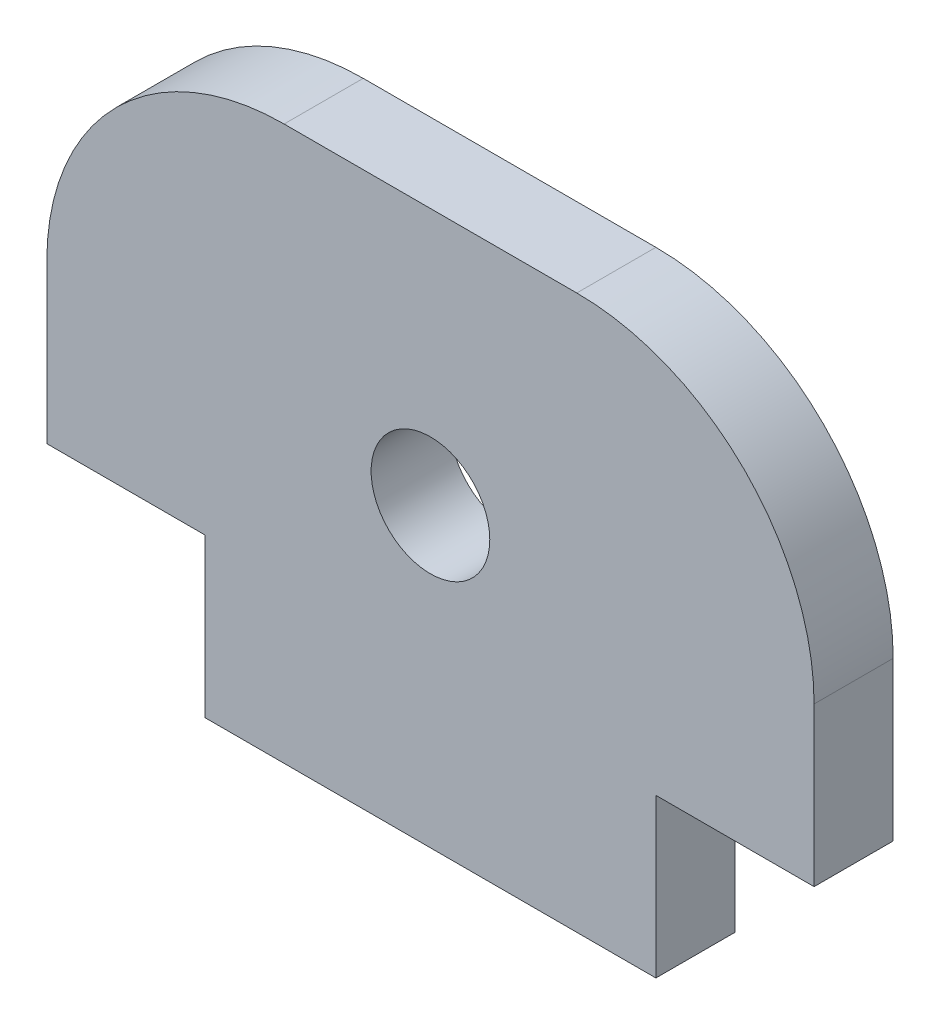
ISO-10303-21;
HEADER;
FILE_DESCRIPTION(('STEP AP214'),'2;1');
FILE_NAME('part.step','',(''),(''),'','','');
FILE_SCHEMA(('AUTOMOTIVE_DESIGN { 1 0 10303 214 1 1 1 1 }'));
ENDSEC;
DATA;
#1=APPLICATION_CONTEXT('core data for automotive mechanical design processes');
#2=APPLICATION_PROTOCOL_DEFINITION('international standard','automotive_design',2000,#1);
#3=PRODUCT_CONTEXT('',#1,'mechanical');
#4=PRODUCT('Part','Part','',(#3));
#5=PRODUCT_RELATED_PRODUCT_CATEGORY('part','',(#4));
#6=PRODUCT_DEFINITION_FORMATION('','',#4);
#7=PRODUCT_DEFINITION_CONTEXT('part definition',#1,'design');
#8=PRODUCT_DEFINITION('design','',#6,#7);
#9=PRODUCT_DEFINITION_SHAPE('','',#8);
#10=(LENGTH_UNIT() NAMED_UNIT(*) SI_UNIT(.MILLI.,.METRE.));
#11=(NAMED_UNIT(*) PLANE_ANGLE_UNIT() SI_UNIT($,.RADIAN.));
#12=(NAMED_UNIT(*) SI_UNIT($,.STERADIAN.) SOLID_ANGLE_UNIT());
#13=UNCERTAINTY_MEASURE_WITH_UNIT(LENGTH_MEASURE(1.E-05),#10,'distance_accuracy_value','');
#14=(GEOMETRIC_REPRESENTATION_CONTEXT(3) GLOBAL_UNCERTAINTY_ASSIGNED_CONTEXT((#13)) GLOBAL_UNIT_ASSIGNED_CONTEXT((#10,
#11,#12)) REPRESENTATION_CONTEXT('',''));
#15=CARTESIAN_POINT('',(0.,0.,0.));
#16=DIRECTION('',(0.,0.,1.));
#17=DIRECTION('',(1.,0.,0.));
#18=AXIS2_PLACEMENT_3D('',#15,#16,#17);
#19=CARTESIAN_POINT('',(3.70000000000026,0.499999999999501,2.));
#20=DIRECTION('',(0.,0.,1.));
#21=DIRECTION('',(1.,0.,0.));
#22=AXIS2_PLACEMENT_3D('',#19,#20,#21);
#23=PLANE('',#22);
#24=CARTESIAN_POINT('',(3.70000000000026,0.499999999999501,2.));
#25=DIRECTION('',(0.,0.,1.));
#26=DIRECTION('',(1.,0.,0.));
#27=AXIS2_PLACEMENT_3D('',#24,#25,#26);
#28=CIRCLE('',#27,5.99999999999989);
#29=CARTESIAN_POINT('',(9.70000000000015,0.499999999999501,2.));
#30=VERTEX_POINT('',#29);
#31=CARTESIAN_POINT('',(3.70000000000026,6.4999999999994,2.));
#32=VERTEX_POINT('',#31);
#33=EDGE_CURVE('E162',#30,#32,#28,.T.);
#34=ORIENTED_EDGE('',*,*,#33,.T.);
#35=DIRECTION('',(-1.,0.,0.));
#36=VECTOR('',#35,1.);
#37=CARTESIAN_POINT('',(-3.7000000000007,6.49999999999951,2.));
#38=LINE('',#37,#36);
#39=CARTESIAN_POINT('',(-3.7000000000007,6.4999999999994,2.));
#40=VERTEX_POINT('',#39);
#41=EDGE_CURVE('E100',#32,#40,#38,.T.);
#42=ORIENTED_EDGE('',*,*,#41,.T.);
#43=CARTESIAN_POINT('',(-3.7000000000007,0.499999999999501,2.));
#44=DIRECTION('',(0.,0.,1.));
#45=DIRECTION('',(1.,0.,0.));
#46=AXIS2_PLACEMENT_3D('',#43,#44,#45);
#47=CIRCLE('',#46,5.99999999999989);
#48=CARTESIAN_POINT('',(-9.70000000000049,0.499999999999501,2.));
#49=VERTEX_POINT('',#48);
#50=EDGE_CURVE('E183',#40,#49,#47,.T.);
#51=ORIENTED_EDGE('',*,*,#50,.T.);
#52=DIRECTION('',(0.,-1.,0.));
#53=VECTOR('',#52,1.);
#54=CARTESIAN_POINT('',(-9.70000000000049,-3.5000000000005,2.));
#55=LINE('',#54,#53);
#56=CARTESIAN_POINT('',(-9.70000000000049,-3.5000000000005,2.));
#57=VERTEX_POINT('',#56);
#58=EDGE_CURVE('E202',#49,#57,#55,.T.);
#59=ORIENTED_EDGE('',*,*,#58,.T.);
#60=DIRECTION('',(1.,0.,0.));
#61=VECTOR('',#60,1.);
#62=CARTESIAN_POINT('',(-9.70000000000049,-3.5000000000005,2.));
#63=LINE('',#62,#61);
#64=CARTESIAN_POINT('',(-5.70000000000048,-3.5000000000005,2.));
#65=VERTEX_POINT('',#64);
#66=EDGE_CURVE('E199',#57,#65,#63,.T.);
#67=ORIENTED_EDGE('',*,*,#66,.T.);
#68=DIRECTION('',(0.,-1.,0.));
#69=VECTOR('',#68,1.);
#70=CARTESIAN_POINT('',(-5.70000000000048,-7.50000000000051,2.));
#71=LINE('',#70,#69);
#72=CARTESIAN_POINT('',(-5.70000000000048,-7.50000000000051,2.));
#73=VERTEX_POINT('',#72);
#74=EDGE_CURVE('E201',#65,#73,#71,.T.);
#75=ORIENTED_EDGE('',*,*,#74,.T.);
#76=DIRECTION('',(1.,0.,0.));
#77=VECTOR('',#76,1.);
#78=CARTESIAN_POINT('',(5.70000000000004,-7.50000000000051,2.));
#79=LINE('',#78,#77);
#80=CARTESIAN_POINT('',(5.70000000000004,-7.50000000000051,2.));
#81=VERTEX_POINT('',#80);
#82=EDGE_CURVE('E125',#73,#81,#79,.T.);
#83=ORIENTED_EDGE('',*,*,#82,.T.);
#84=DIRECTION('',(0.,1.,0.));
#85=VECTOR('',#84,1.);
#86=CARTESIAN_POINT('',(5.70000000000004,-3.5000000000005,2.));
#87=LINE('',#86,#85);
#88=CARTESIAN_POINT('',(5.70000000000004,-3.5000000000005,2.));
#89=VERTEX_POINT('',#88);
#90=EDGE_CURVE('E119',#81,#89,#87,.T.);
#91=ORIENTED_EDGE('',*,*,#90,.T.);
#92=DIRECTION('',(1.,0.,0.));
#93=VECTOR('',#92,1.);
#94=CARTESIAN_POINT('',(9.70000000000015,-3.5000000000005,2.));
#95=LINE('',#94,#93);
#96=CARTESIAN_POINT('',(9.70000000000015,-3.5000000000005,2.));
#97=VERTEX_POINT('',#96);
#98=EDGE_CURVE('E123',#89,#97,#95,.T.);
#99=ORIENTED_EDGE('',*,*,#98,.T.);
#100=DIRECTION('',(0.,1.,0.));
#101=VECTOR('',#100,1.);
#102=CARTESIAN_POINT('',(9.70000000000015,-3.5000000000005,2.));
#103=LINE('',#102,#101);
#104=EDGE_CURVE('E51',#97,#30,#103,.T.);
#105=ORIENTED_EDGE('',*,*,#104,.T.);
#106=EDGE_LOOP('',(#34,#42,#51,#59,#67,#75,#83,#91,#99,#105));
#107=FACE_BOUND('',#106,.T.);
#108=CARTESIAN_POINT('',(0.,0.,2.));
#109=DIRECTION('',(0.,0.,1.));
#110=DIRECTION('',(1.,0.,0.));
#111=AXIS2_PLACEMENT_3D('',#108,#109,#110);
#112=CIRCLE('',#111,1.50000000000006);
#113=CARTESIAN_POINT('',(1.50000000000006,0.,2.));
#114=VERTEX_POINT('',#113);
#115=EDGE_CURVE('E147',#114,#114,#112,.T.);
#116=ORIENTED_EDGE('',*,*,#115,.F.);
#117=EDGE_LOOP('',(#116));
#118=FACE_BOUND('',#117,.T.);
#119=ADVANCED_FACE('F34',(#107,#118),#23,.T.);
#120=CARTESIAN_POINT('',(3.70000000000026,0.499999999999501,0.));
#121=DIRECTION('',(0.,0.,1.));
#122=DIRECTION('',(1.,0.,0.));
#123=AXIS2_PLACEMENT_3D('',#120,#121,#122);
#124=PLANE('',#123);
#125=CARTESIAN_POINT('',(3.70000000000026,0.499999999999501,0.));
#126=DIRECTION('',(0.,0.,1.));
#127=DIRECTION('',(1.,0.,0.));
#128=AXIS2_PLACEMENT_3D('',#125,#126,#127);
#129=CIRCLE('',#128,5.99999999999989);
#130=CARTESIAN_POINT('',(9.70000000000015,0.499999999999501,0.));
#131=VERTEX_POINT('',#130);
#132=CARTESIAN_POINT('',(3.70000000000026,6.4999999999994,0.));
#133=VERTEX_POINT('',#132);
#134=EDGE_CURVE('E143',#131,#133,#129,.T.);
#135=ORIENTED_EDGE('',*,*,#134,.F.);
#136=DIRECTION('',(0.,1.,0.));
#137=VECTOR('',#136,1.);
#138=CARTESIAN_POINT('',(9.70000000000015,-3.5000000000005,0.));
#139=LINE('',#138,#137);
#140=CARTESIAN_POINT('',(9.70000000000015,-3.5000000000005,0.));
#141=VERTEX_POINT('',#140);
#142=EDGE_CURVE('E92',#141,#131,#139,.T.);
#143=ORIENTED_EDGE('',*,*,#142,.F.);
#144=DIRECTION('',(1.,0.,0.));
#145=VECTOR('',#144,1.);
#146=CARTESIAN_POINT('',(9.70000000000015,-3.5000000000005,0.));
#147=LINE('',#146,#145);
#148=CARTESIAN_POINT('',(5.70000000000004,-3.5000000000005,0.));
#149=VERTEX_POINT('',#148);
#150=EDGE_CURVE('E86',#149,#141,#147,.T.);
#151=ORIENTED_EDGE('',*,*,#150,.F.);
#152=DIRECTION('',(0.,1.,0.));
#153=VECTOR('',#152,1.);
#154=CARTESIAN_POINT('',(5.70000000000004,-3.5000000000005,0.));
#155=LINE('',#154,#153);
#156=CARTESIAN_POINT('',(5.70000000000004,-7.50000000000051,0.));
#157=VERTEX_POINT('',#156);
#158=EDGE_CURVE('E133',#157,#149,#155,.T.);
#159=ORIENTED_EDGE('',*,*,#158,.F.);
#160=DIRECTION('',(1.,0.,0.));
#161=VECTOR('',#160,1.);
#162=CARTESIAN_POINT('',(5.70000000000004,-7.50000000000051,0.));
#163=LINE('',#162,#161);
#164=CARTESIAN_POINT('',(-5.70000000000048,-7.50000000000051,0.));
#165=VERTEX_POINT('',#164);
#166=EDGE_CURVE('E157',#165,#157,#163,.T.);
#167=ORIENTED_EDGE('',*,*,#166,.F.);
#168=DIRECTION('',(0.,-1.,0.));
#169=VECTOR('',#168,1.);
#170=CARTESIAN_POINT('',(-5.70000000000048,-7.50000000000051,0.));
#171=LINE('',#170,#169);
#172=CARTESIAN_POINT('',(-5.70000000000048,-3.5000000000005,0.));
#173=VERTEX_POINT('',#172);
#174=EDGE_CURVE('E155',#173,#165,#171,.T.);
#175=ORIENTED_EDGE('',*,*,#174,.F.);
#176=DIRECTION('',(1.,0.,0.));
#177=VECTOR('',#176,1.);
#178=CARTESIAN_POINT('',(-9.70000000000049,-3.5000000000005,0.));
#179=LINE('',#178,#177);
#180=CARTESIAN_POINT('',(-9.70000000000049,-3.5000000000005,0.));
#181=VERTEX_POINT('',#180);
#182=EDGE_CURVE('E153',#181,#173,#179,.T.);
#183=ORIENTED_EDGE('',*,*,#182,.F.);
#184=DIRECTION('',(0.,-1.,0.));
#185=VECTOR('',#184,1.);
#186=CARTESIAN_POINT('',(-9.70000000000049,-3.5000000000005,0.));
#187=LINE('',#186,#185);
#188=CARTESIAN_POINT('',(-9.70000000000049,0.499999999999501,0.));
#189=VERTEX_POINT('',#188);
#190=EDGE_CURVE('E151',#189,#181,#187,.T.);
#191=ORIENTED_EDGE('',*,*,#190,.F.);
#192=CARTESIAN_POINT('',(-3.7000000000007,0.499999999999501,0.));
#193=DIRECTION('',(0.,0.,1.));
#194=DIRECTION('',(1.,0.,0.));
#195=AXIS2_PLACEMENT_3D('',#192,#193,#194);
#196=CIRCLE('',#195,5.99999999999989);
#197=CARTESIAN_POINT('',(-3.7000000000007,6.4999999999994,0.));
#198=VERTEX_POINT('',#197);
#199=EDGE_CURVE('E149',#198,#189,#196,.T.);
#200=ORIENTED_EDGE('',*,*,#199,.F.);
#201=DIRECTION('',(-1.,0.,0.));
#202=VECTOR('',#201,1.);
#203=CARTESIAN_POINT('',(-3.7000000000007,6.49999999999951,0.));
#204=LINE('',#203,#202);
#205=EDGE_CURVE('E146',#133,#198,#204,.T.);
#206=ORIENTED_EDGE('',*,*,#205,.F.);
#207=EDGE_LOOP('',(#135,#143,#151,#159,#167,#175,#183,#191,#200,#206));
#208=FACE_BOUND('',#207,.T.);
#209=CARTESIAN_POINT('',(0.,0.,0.));
#210=DIRECTION('',(0.,0.,1.));
#211=DIRECTION('',(1.,0.,0.));
#212=AXIS2_PLACEMENT_3D('',#209,#210,#211);
#213=CIRCLE('',#212,1.50000000000006);
#214=CARTESIAN_POINT('',(1.50000000000006,0.,0.));
#215=VERTEX_POINT('',#214);
#216=EDGE_CURVE('E210',#215,#215,#213,.T.);
#217=ORIENTED_EDGE('',*,*,#216,.T.);
#218=EDGE_LOOP('',(#217));
#219=FACE_BOUND('',#218,.T.);
#220=ADVANCED_FACE('F187',(#208,#219),#124,.F.);
#221=CARTESIAN_POINT('',(3.70000000000026,0.499999999999501,2.));
#222=DIRECTION('',(0.,0.,-1.));
#223=DIRECTION('',(-1.,0.,0.));
#224=AXIS2_PLACEMENT_3D('',#221,#222,#223);
#225=CYLINDRICAL_SURFACE('',#224,5.99999999999989);
#226=ORIENTED_EDGE('',*,*,#134,.T.);
#227=DIRECTION('',(0.,0.,-1.));
#228=VECTOR('',#227,1.);
#229=CARTESIAN_POINT('',(3.70000000000026,6.4999999999994,2.));
#230=LINE('',#229,#228);
#231=EDGE_CURVE('E11',#32,#133,#230,.T.);
#232=ORIENTED_EDGE('',*,*,#231,.F.);
#233=ORIENTED_EDGE('',*,*,#33,.F.);
#234=DIRECTION('',(0.,0.,-1.));
#235=VECTOR('',#234,1.);
#236=CARTESIAN_POINT('',(9.70000000000015,0.499999999999501,2.));
#237=LINE('',#236,#235);
#238=EDGE_CURVE('E139',#30,#131,#237,.T.);
#239=ORIENTED_EDGE('',*,*,#238,.T.);
#240=EDGE_LOOP('',(#226,#232,#233,#239));
#241=FACE_BOUND('',#240,.T.);
#242=ADVANCED_FACE('F36',(#241),#225,.T.);
#243=CARTESIAN_POINT('',(-3.7000000000007,6.49999999999951,2.));
#244=DIRECTION('',(0.,-1.,0.));
#245=DIRECTION('',(1.,0.,0.));
#246=AXIS2_PLACEMENT_3D('',#243,#244,#245);
#247=PLANE('',#246);
#248=ORIENTED_EDGE('',*,*,#205,.T.);
#249=DIRECTION('',(0.,0.,-1.));
#250=VECTOR('',#249,1.);
#251=CARTESIAN_POINT('',(-3.7000000000007,6.4999999999994,2.));
#252=LINE('',#251,#250);
#253=EDGE_CURVE('E43',#40,#198,#252,.T.);
#254=ORIENTED_EDGE('',*,*,#253,.F.);
#255=ORIENTED_EDGE('',*,*,#41,.F.);
#256=ORIENTED_EDGE('',*,*,#231,.T.);
#257=EDGE_LOOP('',(#248,#254,#255,#256));
#258=FACE_BOUND('',#257,.T.);
#259=ADVANCED_FACE('F246',(#258),#247,.F.);
#260=CARTESIAN_POINT('',(-3.7000000000007,0.499999999999501,2.));
#261=DIRECTION('',(0.,0.,-1.));
#262=DIRECTION('',(-1.,0.,0.));
#263=AXIS2_PLACEMENT_3D('',#260,#261,#262);
#264=CYLINDRICAL_SURFACE('',#263,5.99999999999989);
#265=ORIENTED_EDGE('',*,*,#199,.T.);
#266=DIRECTION('',(0.,0.,-1.));
#267=VECTOR('',#266,1.);
#268=CARTESIAN_POINT('',(-9.70000000000049,0.499999999999501,2.));
#269=LINE('',#268,#267);
#270=EDGE_CURVE('E175',#49,#189,#269,.T.);
#271=ORIENTED_EDGE('',*,*,#270,.F.);
#272=ORIENTED_EDGE('',*,*,#50,.F.);
#273=ORIENTED_EDGE('',*,*,#253,.T.);
#274=EDGE_LOOP('',(#265,#271,#272,#273));
#275=FACE_BOUND('',#274,.T.);
#276=ADVANCED_FACE('F181',(#275),#264,.T.);
#277=CARTESIAN_POINT('',(-9.70000000000049,-3.5000000000005,2.));
#278=DIRECTION('',(1.,0.,0.));
#279=DIRECTION('',(0.,0.,-1.));
#280=AXIS2_PLACEMENT_3D('',#277,#278,#279);
#281=PLANE('',#280);
#282=ORIENTED_EDGE('',*,*,#190,.T.);
#283=DIRECTION('',(0.,0.,-1.));
#284=VECTOR('',#283,1.);
#285=CARTESIAN_POINT('',(-9.70000000000049,-3.5000000000005,2.));
#286=LINE('',#285,#284);
#287=EDGE_CURVE('E172',#57,#181,#286,.T.);
#288=ORIENTED_EDGE('',*,*,#287,.F.);
#289=ORIENTED_EDGE('',*,*,#58,.F.);
#290=ORIENTED_EDGE('',*,*,#270,.T.);
#291=EDGE_LOOP('',(#282,#288,#289,#290));
#292=FACE_BOUND('',#291,.T.);
#293=ADVANCED_FACE('F193',(#292),#281,.F.);
#294=CARTESIAN_POINT('',(-9.70000000000049,-3.5000000000005,2.));
#295=DIRECTION('',(0.,1.,0.));
#296=DIRECTION('',(0.,0.,1.));
#297=AXIS2_PLACEMENT_3D('',#294,#295,#296);
#298=PLANE('',#297);
#299=ORIENTED_EDGE('',*,*,#182,.T.);
#300=DIRECTION('',(0.,0.,-1.));
#301=VECTOR('',#300,1.);
#302=CARTESIAN_POINT('',(-5.70000000000048,-3.5000000000005,2.));
#303=LINE('',#302,#301);
#304=EDGE_CURVE('E169',#65,#173,#303,.T.);
#305=ORIENTED_EDGE('',*,*,#304,.F.);
#306=ORIENTED_EDGE('',*,*,#66,.F.);
#307=ORIENTED_EDGE('',*,*,#287,.T.);
#308=EDGE_LOOP('',(#299,#305,#306,#307));
#309=FACE_BOUND('',#308,.T.);
#310=ADVANCED_FACE('F197',(#309),#298,.F.);
#311=CARTESIAN_POINT('',(-5.70000000000048,-7.50000000000051,2.));
#312=DIRECTION('',(1.,0.,0.));
#313=DIRECTION('',(0.,0.,-1.));
#314=AXIS2_PLACEMENT_3D('',#311,#312,#313);
#315=PLANE('',#314);
#316=ORIENTED_EDGE('',*,*,#174,.T.);
#317=DIRECTION('',(0.,0.,-1.));
#318=VECTOR('',#317,1.);
#319=CARTESIAN_POINT('',(-5.70000000000048,-7.50000000000051,2.));
#320=LINE('',#319,#318);
#321=EDGE_CURVE('E166',#73,#165,#320,.T.);
#322=ORIENTED_EDGE('',*,*,#321,.F.);
#323=ORIENTED_EDGE('',*,*,#74,.F.);
#324=ORIENTED_EDGE('',*,*,#304,.T.);
#325=EDGE_LOOP('',(#316,#322,#323,#324));
#326=FACE_BOUND('',#325,.T.);
#327=ADVANCED_FACE('F236',(#326),#315,.F.);
#328=CARTESIAN_POINT('',(5.70000000000004,-7.50000000000051,2.));
#329=DIRECTION('',(0.,1.,0.));
#330=DIRECTION('',(0.,0.,1.));
#331=AXIS2_PLACEMENT_3D('',#328,#329,#330);
#332=PLANE('',#331);
#333=ORIENTED_EDGE('',*,*,#166,.T.);
#334=DIRECTION('',(0.,0.,-1.));
#335=VECTOR('',#334,1.);
#336=CARTESIAN_POINT('',(5.70000000000004,-7.50000000000051,2.));
#337=LINE('',#336,#335);
#338=EDGE_CURVE('E134',#81,#157,#337,.T.);
#339=ORIENTED_EDGE('',*,*,#338,.F.);
#340=ORIENTED_EDGE('',*,*,#82,.F.);
#341=ORIENTED_EDGE('',*,*,#321,.T.);
#342=EDGE_LOOP('',(#333,#339,#340,#341));
#343=FACE_BOUND('',#342,.T.);
#344=ADVANCED_FACE('F233',(#343),#332,.F.);
#345=CARTESIAN_POINT('',(5.70000000000004,-3.5000000000005,2.));
#346=DIRECTION('',(-1.,0.,0.));
#347=DIRECTION('',(0.,0.,1.));
#348=AXIS2_PLACEMENT_3D('',#345,#346,#347);
#349=PLANE('',#348);
#350=ORIENTED_EDGE('',*,*,#158,.T.);
#351=DIRECTION('',(0.,0.,-1.));
#352=VECTOR('',#351,1.);
#353=CARTESIAN_POINT('',(5.70000000000004,-3.5000000000005,2.));
#354=LINE('',#353,#352);
#355=EDGE_CURVE('E130',#89,#149,#354,.T.);
#356=ORIENTED_EDGE('',*,*,#355,.F.);
#357=ORIENTED_EDGE('',*,*,#90,.F.);
#358=ORIENTED_EDGE('',*,*,#338,.T.);
#359=EDGE_LOOP('',(#350,#356,#357,#358));
#360=FACE_BOUND('',#359,.T.);
#361=ADVANCED_FACE('F131',(#360),#349,.F.);
#362=CARTESIAN_POINT('',(9.70000000000015,-3.5000000000005,2.));
#363=DIRECTION('',(0.,1.,0.));
#364=DIRECTION('',(0.,0.,1.));
#365=AXIS2_PLACEMENT_3D('',#362,#363,#364);
#366=PLANE('',#365);
#367=ORIENTED_EDGE('',*,*,#150,.T.);
#368=DIRECTION('',(0.,0.,-1.));
#369=VECTOR('',#368,1.);
#370=CARTESIAN_POINT('',(9.70000000000015,-3.5000000000005,2.));
#371=LINE('',#370,#369);
#372=EDGE_CURVE('E135',#97,#141,#371,.T.);
#373=ORIENTED_EDGE('',*,*,#372,.F.);
#374=ORIENTED_EDGE('',*,*,#98,.F.);
#375=ORIENTED_EDGE('',*,*,#355,.T.);
#376=EDGE_LOOP('',(#367,#373,#374,#375));
#377=FACE_BOUND('',#376,.T.);
#378=ADVANCED_FACE('F137',(#377),#366,.F.);
#379=CARTESIAN_POINT('',(9.70000000000015,-3.5000000000005,2.));
#380=DIRECTION('',(-1.,0.,0.));
#381=DIRECTION('',(0.,0.,1.));
#382=AXIS2_PLACEMENT_3D('',#379,#380,#381);
#383=PLANE('',#382);
#384=ORIENTED_EDGE('',*,*,#142,.T.);
#385=ORIENTED_EDGE('',*,*,#238,.F.);
#386=ORIENTED_EDGE('',*,*,#104,.F.);
#387=ORIENTED_EDGE('',*,*,#372,.T.);
#388=EDGE_LOOP('',(#384,#385,#386,#387));
#389=FACE_BOUND('',#388,.T.);
#390=ADVANCED_FACE('F226',(#389),#383,.F.);
#391=CARTESIAN_POINT('',(0.,0.,2.));
#392=DIRECTION('',(0.,0.,-1.));
#393=DIRECTION('',(-1.,0.,0.));
#394=AXIS2_PLACEMENT_3D('',#391,#392,#393);
#395=CYLINDRICAL_SURFACE('',#394,1.50000000000006);
#396=ORIENTED_EDGE('',*,*,#115,.T.);
#397=EDGE_LOOP('',(#396));
#398=FACE_BOUND('',#397,.T.);
#399=ORIENTED_EDGE('',*,*,#216,.F.);
#400=EDGE_LOOP('',(#399));
#401=FACE_BOUND('',#400,.T.);
#402=ADVANCED_FACE('F216',(#398,#401),#395,.F.);
#403=CLOSED_SHELL('',(#119,#220,#242,#259,#276,#293,#310,#327,#344,#361,#378,#390,#402));
#404=MANIFOLD_SOLID_BREP('B2',#403);
#405=ADVANCED_BREP_SHAPE_REPRESENTATION('',(#18,#404),#14);
#406=SHAPE_DEFINITION_REPRESENTATION(#9,#405);
ENDSEC;
END-ISO-10303-21;
